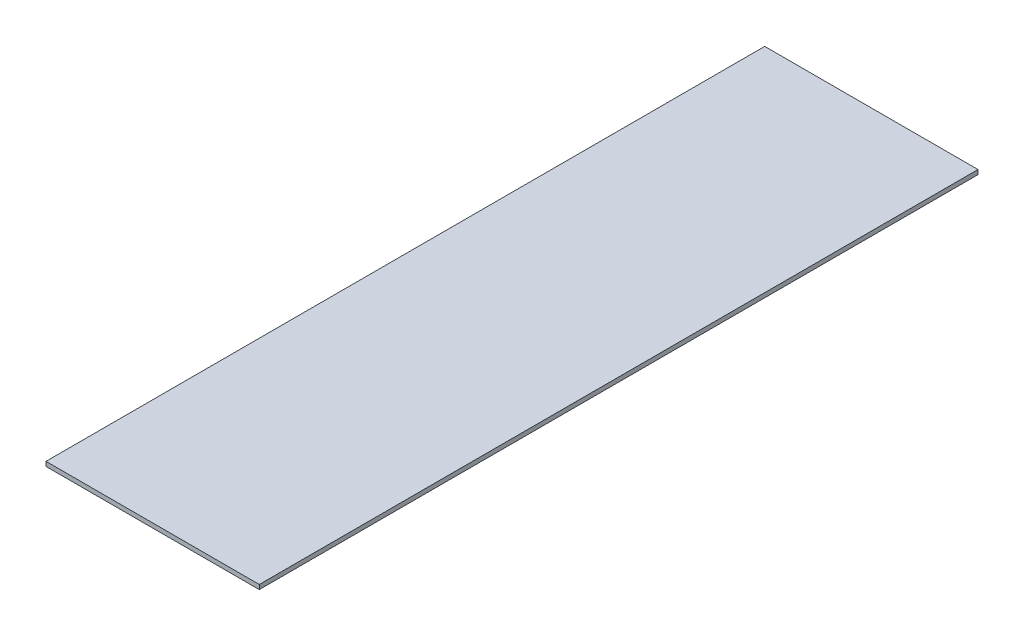
ISO-10303-21;
HEADER;
FILE_DESCRIPTION(('STEP AP214'),'2;1');
FILE_NAME('part.step','',(''),(''),'','','');
FILE_SCHEMA(('AUTOMOTIVE_DESIGN { 1 0 10303 214 1 1 1 1 }'));
ENDSEC;
DATA;
#1=APPLICATION_CONTEXT('core data for automotive mechanical design processes');
#2=APPLICATION_PROTOCOL_DEFINITION('international standard','automotive_design',2000,#1);
#3=PRODUCT_CONTEXT('',#1,'mechanical');
#4=PRODUCT('Part','Part','',(#3));
#5=PRODUCT_RELATED_PRODUCT_CATEGORY('part','',(#4));
#6=PRODUCT_DEFINITION_FORMATION('','',#4);
#7=PRODUCT_DEFINITION_CONTEXT('part definition',#1,'design');
#8=PRODUCT_DEFINITION('design','',#6,#7);
#9=PRODUCT_DEFINITION_SHAPE('','',#8);
#10=(LENGTH_UNIT() NAMED_UNIT(*) SI_UNIT(.MILLI.,.METRE.));
#11=(NAMED_UNIT(*) PLANE_ANGLE_UNIT() SI_UNIT($,.RADIAN.));
#12=(NAMED_UNIT(*) SI_UNIT($,.STERADIAN.) SOLID_ANGLE_UNIT());
#13=UNCERTAINTY_MEASURE_WITH_UNIT(LENGTH_MEASURE(1.E-05),#10,'distance_accuracy_value','');
#14=(GEOMETRIC_REPRESENTATION_CONTEXT(3) GLOBAL_UNCERTAINTY_ASSIGNED_CONTEXT((#13)) GLOBAL_UNIT_ASSIGNED_CONTEXT((#10,
#11,#12)) REPRESENTATION_CONTEXT('',''));
#15=CARTESIAN_POINT('',(0.,0.,0.));
#16=DIRECTION('',(0.,0.,1.));
#17=DIRECTION('',(1.,0.,0.));
#18=AXIS2_PLACEMENT_3D('',#15,#16,#17);
#19=CARTESIAN_POINT('',(2.,2.,-2.));
#20=DIRECTION('',(-1.,0.,0.));
#21=DIRECTION('',(0.,0.,1.));
#22=AXIS2_PLACEMENT_3D('',#19,#20,#21);
#23=PLANE('',#22);
#24=DIRECTION('',(0.,0.,-1.));
#25=VECTOR('',#24,1.);
#26=CARTESIAN_POINT('',(2.,0.,-2.));
#27=LINE('',#26,#25);
#28=CARTESIAN_POINT('',(2.,0.,-2.));
#29=VERTEX_POINT('',#28);
#30=CARTESIAN_POINT('',(2.,0.,-325.5));
#31=VERTEX_POINT('',#30);
#32=EDGE_CURVE('E100',#29,#31,#27,.T.);
#33=ORIENTED_EDGE('',*,*,#32,.F.);
#34=DIRECTION('',(0.,-1.,0.));
#35=VECTOR('',#34,1.);
#36=CARTESIAN_POINT('',(2.,2.,-2.));
#37=LINE('',#36,#35);
#38=CARTESIAN_POINT('',(2.,2.,-2.));
#39=VERTEX_POINT('',#38);
#40=EDGE_CURVE('E11',#39,#29,#37,.T.);
#41=ORIENTED_EDGE('',*,*,#40,.F.);
#42=DIRECTION('',(0.,0.,-1.));
#43=VECTOR('',#42,1.);
#44=CARTESIAN_POINT('',(2.,2.,-2.));
#45=LINE('',#44,#43);
#46=CARTESIAN_POINT('',(2.,2.,-325.5));
#47=VERTEX_POINT('',#46);
#48=EDGE_CURVE('E95',#39,#47,#45,.T.);
#49=ORIENTED_EDGE('',*,*,#48,.T.);
#50=DIRECTION('',(0.,-1.,0.));
#51=VECTOR('',#50,1.);
#52=CARTESIAN_POINT('',(2.,2.,-325.5));
#53=LINE('',#52,#51);
#54=EDGE_CURVE('E38',#47,#31,#53,.T.);
#55=ORIENTED_EDGE('',*,*,#54,.T.);
#56=EDGE_LOOP('',(#33,#41,#49,#55));
#57=FACE_BOUND('',#56,.T.);
#58=ADVANCED_FACE('F35',(#57),#23,.T.);
#59=CARTESIAN_POINT('',(2.,2.,-2.));
#60=DIRECTION('',(0.,0.,-1.));
#61=DIRECTION('',(-1.,0.,0.));
#62=AXIS2_PLACEMENT_3D('',#59,#60,#61);
#63=PLANE('',#62);
#64=DIRECTION('',(1.,0.,0.));
#65=VECTOR('',#64,1.);
#66=CARTESIAN_POINT('',(2.,0.,-2.));
#67=LINE('',#66,#65);
#68=CARTESIAN_POINT('',(98.,0.,-2.));
#69=VERTEX_POINT('',#68);
#70=EDGE_CURVE('E68',#29,#69,#67,.T.);
#71=ORIENTED_EDGE('',*,*,#70,.T.);
#72=DIRECTION('',(0.,-1.,0.));
#73=VECTOR('',#72,1.);
#74=CARTESIAN_POINT('',(98.,2.,-2.));
#75=LINE('',#74,#73);
#76=CARTESIAN_POINT('',(98.,2.,-2.));
#77=VERTEX_POINT('',#76);
#78=EDGE_CURVE('E44',#77,#69,#75,.T.);
#79=ORIENTED_EDGE('',*,*,#78,.F.);
#80=DIRECTION('',(1.,0.,0.));
#81=VECTOR('',#80,1.);
#82=CARTESIAN_POINT('',(2.,2.,-2.));
#83=LINE('',#82,#81);
#84=EDGE_CURVE('E85',#39,#77,#83,.T.);
#85=ORIENTED_EDGE('',*,*,#84,.F.);
#86=ORIENTED_EDGE('',*,*,#40,.T.);
#87=EDGE_LOOP('',(#71,#79,#85,#86));
#88=FACE_BOUND('',#87,.T.);
#89=ADVANCED_FACE('F110',(#88),#63,.F.);
#90=CARTESIAN_POINT('',(98.,2.,-2.));
#91=DIRECTION('',(-1.,0.,0.));
#92=DIRECTION('',(0.,0.,1.));
#93=AXIS2_PLACEMENT_3D('',#90,#91,#92);
#94=PLANE('',#93);
#95=DIRECTION('',(0.,0.,-1.));
#96=VECTOR('',#95,1.);
#97=CARTESIAN_POINT('',(98.,0.,-2.));
#98=LINE('',#97,#96);
#99=CARTESIAN_POINT('',(98.,0.,-325.5));
#100=VERTEX_POINT('',#99);
#101=EDGE_CURVE('E92',#69,#100,#98,.T.);
#102=ORIENTED_EDGE('',*,*,#101,.T.);
#103=DIRECTION('',(0.,-1.,0.));
#104=VECTOR('',#103,1.);
#105=CARTESIAN_POINT('',(98.,2.,-325.5));
#106=LINE('',#105,#104);
#107=CARTESIAN_POINT('',(98.,2.,-325.5));
#108=VERTEX_POINT('',#107);
#109=EDGE_CURVE('E89',#108,#100,#106,.T.);
#110=ORIENTED_EDGE('',*,*,#109,.F.);
#111=DIRECTION('',(0.,0.,-1.));
#112=VECTOR('',#111,1.);
#113=CARTESIAN_POINT('',(98.,2.,-2.));
#114=LINE('',#113,#112);
#115=EDGE_CURVE('E80',#77,#108,#114,.T.);
#116=ORIENTED_EDGE('',*,*,#115,.F.);
#117=ORIENTED_EDGE('',*,*,#78,.T.);
#118=EDGE_LOOP('',(#102,#110,#116,#117));
#119=FACE_BOUND('',#118,.T.);
#120=ADVANCED_FACE('F90',(#119),#94,.F.);
#121=CARTESIAN_POINT('',(2.,2.,-325.5));
#122=DIRECTION('',(0.,0.,-1.));
#123=DIRECTION('',(-1.,0.,0.));
#124=AXIS2_PLACEMENT_3D('',#121,#122,#123);
#125=PLANE('',#124);
#126=DIRECTION('',(1.,0.,0.));
#127=VECTOR('',#126,1.);
#128=CARTESIAN_POINT('',(2.,0.,-325.5));
#129=LINE('',#128,#127);
#130=EDGE_CURVE('E103',#31,#100,#129,.T.);
#131=ORIENTED_EDGE('',*,*,#130,.F.);
#132=ORIENTED_EDGE('',*,*,#54,.F.);
#133=DIRECTION('',(1.,0.,0.));
#134=VECTOR('',#133,1.);
#135=CARTESIAN_POINT('',(2.,2.,-325.5));
#136=LINE('',#135,#134);
#137=EDGE_CURVE('E84',#47,#108,#136,.T.);
#138=ORIENTED_EDGE('',*,*,#137,.T.);
#139=ORIENTED_EDGE('',*,*,#109,.T.);
#140=EDGE_LOOP('',(#131,#132,#138,#139));
#141=FACE_BOUND('',#140,.T.);
#142=ADVANCED_FACE('F94',(#141),#125,.T.);
#143=CARTESIAN_POINT('',(0.,2.,0.));
#144=DIRECTION('',(0.,-1.,0.));
#145=DIRECTION('',(0.,0.,-1.));
#146=AXIS2_PLACEMENT_3D('',#143,#144,#145);
#147=PLANE('',#146);
#148=ORIENTED_EDGE('',*,*,#48,.F.);
#149=ORIENTED_EDGE('',*,*,#84,.T.);
#150=ORIENTED_EDGE('',*,*,#115,.T.);
#151=ORIENTED_EDGE('',*,*,#137,.F.);
#152=EDGE_LOOP('',(#148,#149,#150,#151));
#153=FACE_BOUND('',#152,.T.);
#154=ADVANCED_FACE('F83',(#153),#147,.F.);
#155=CARTESIAN_POINT('',(0.,0.,0.));
#156=DIRECTION('',(0.,-1.,0.));
#157=DIRECTION('',(0.,0.,-1.));
#158=AXIS2_PLACEMENT_3D('',#155,#156,#157);
#159=PLANE('',#158);
#160=ORIENTED_EDGE('',*,*,#32,.T.);
#161=ORIENTED_EDGE('',*,*,#130,.T.);
#162=ORIENTED_EDGE('',*,*,#101,.F.);
#163=ORIENTED_EDGE('',*,*,#70,.F.);
#164=EDGE_LOOP('',(#160,#161,#162,#163));
#165=FACE_BOUND('',#164,.T.);
#166=ADVANCED_FACE('F108',(#165),#159,.T.);
#167=CLOSED_SHELL('',(#58,#89,#120,#142,#154,#166));
#168=MANIFOLD_SOLID_BREP('B2',#167);
#169=ADVANCED_BREP_SHAPE_REPRESENTATION('',(#18,#168),#14);
#170=SHAPE_DEFINITION_REPRESENTATION(#9,#169);
ENDSEC;
END-ISO-10303-21;
